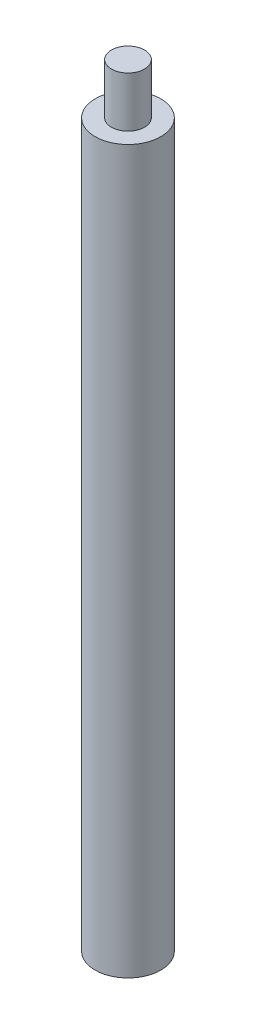
ISO-10303-21;
HEADER;
FILE_DESCRIPTION(('STEP AP214'),'2;1');
FILE_NAME('part.step','',(''),(''),'','','');
FILE_SCHEMA(('AUTOMOTIVE_DESIGN { 1 0 10303 214 1 1 1 1 }'));
ENDSEC;
DATA;
#1=APPLICATION_CONTEXT('core data for automotive mechanical design processes');
#2=APPLICATION_PROTOCOL_DEFINITION('international standard','automotive_design',2000,#1);
#3=PRODUCT_CONTEXT('',#1,'mechanical');
#4=PRODUCT('Part','Part','',(#3));
#5=PRODUCT_RELATED_PRODUCT_CATEGORY('part','',(#4));
#6=PRODUCT_DEFINITION_FORMATION('','',#4);
#7=PRODUCT_DEFINITION_CONTEXT('part definition',#1,'design');
#8=PRODUCT_DEFINITION('design','',#6,#7);
#9=PRODUCT_DEFINITION_SHAPE('','',#8);
#10=(LENGTH_UNIT() NAMED_UNIT(*) SI_UNIT(.MILLI.,.METRE.));
#11=(NAMED_UNIT(*) PLANE_ANGLE_UNIT() SI_UNIT($,.RADIAN.));
#12=(NAMED_UNIT(*) SI_UNIT($,.STERADIAN.) SOLID_ANGLE_UNIT());
#13=UNCERTAINTY_MEASURE_WITH_UNIT(LENGTH_MEASURE(1.E-05),#10,'distance_accuracy_value','');
#14=(GEOMETRIC_REPRESENTATION_CONTEXT(3) GLOBAL_UNCERTAINTY_ASSIGNED_CONTEXT((#13)) GLOBAL_UNIT_ASSIGNED_CONTEXT((#10,
#11,#12)) REPRESENTATION_CONTEXT('',''));
#15=CARTESIAN_POINT('',(0.,0.,0.));
#16=DIRECTION('',(0.,0.,1.));
#17=DIRECTION('',(1.,0.,0.));
#18=AXIS2_PLACEMENT_3D('',#15,#16,#17);
#19=CARTESIAN_POINT('',(0.,43.6372,0.));
#20=DIRECTION('',(0.,-1.,0.));
#21=DIRECTION('',(0.,0.,-1.));
#22=AXIS2_PLACEMENT_3D('',#19,#20,#21);
#23=CYLINDRICAL_SURFACE('',#22,1.984375);
#24=CARTESIAN_POINT('',(0.,43.6372,0.));
#25=DIRECTION('',(0.,1.,0.));
#26=DIRECTION('',(0.,0.,1.));
#27=AXIS2_PLACEMENT_3D('',#24,#25,#26);
#28=CIRCLE('',#27,1.984375);
#29=CARTESIAN_POINT('',(0.,43.6372,1.984375));
#30=VERTEX_POINT('',#29);
#31=EDGE_CURVE('E11',#30,#30,#28,.T.);
#32=ORIENTED_EDGE('',*,*,#31,.F.);
#33=EDGE_LOOP('',(#32));
#34=FACE_BOUND('',#33,.T.);
#35=CARTESIAN_POINT('',(0.,0.,0.));
#36=DIRECTION('',(0.,1.,0.));
#37=DIRECTION('',(0.,0.,1.));
#38=AXIS2_PLACEMENT_3D('',#35,#36,#37);
#39=CIRCLE('',#38,1.984375);
#40=CARTESIAN_POINT('',(0.,0.,1.984375));
#41=VERTEX_POINT('',#40);
#42=EDGE_CURVE('E44',#41,#41,#39,.T.);
#43=ORIENTED_EDGE('',*,*,#42,.T.);
#44=EDGE_LOOP('',(#43));
#45=FACE_BOUND('',#44,.T.);
#46=ADVANCED_FACE('F41',(#34,#45),#23,.T.);
#47=CARTESIAN_POINT('',(0.,43.6372,0.));
#48=DIRECTION('',(0.,1.,0.));
#49=DIRECTION('',(0.,0.,1.));
#50=AXIS2_PLACEMENT_3D('',#47,#48,#49);
#51=PLANE('',#50);
#52=CARTESIAN_POINT('',(0.,43.6372,0.));
#53=DIRECTION('',(0.,1.,0.));
#54=DIRECTION('',(0.,0.,1.));
#55=AXIS2_PLACEMENT_3D('',#52,#53,#54);
#56=CIRCLE('',#55,1.);
#57=CARTESIAN_POINT('',(0.,43.6372,1.));
#58=VERTEX_POINT('',#57);
#59=EDGE_CURVE('E62',#58,#58,#56,.T.);
#60=ORIENTED_EDGE('',*,*,#59,.F.);
#61=EDGE_LOOP('',(#60));
#62=FACE_BOUND('',#61,.T.);
#63=ORIENTED_EDGE('',*,*,#31,.T.);
#64=EDGE_LOOP('',(#63));
#65=FACE_BOUND('',#64,.T.);
#66=ADVANCED_FACE('F85',(#62,#65),#51,.T.);
#67=CARTESIAN_POINT('',(0.,0.,0.));
#68=DIRECTION('',(0.,1.,0.));
#69=DIRECTION('',(0.,0.,1.));
#70=AXIS2_PLACEMENT_3D('',#67,#68,#69);
#71=PLANE('',#70);
#72=CARTESIAN_POINT('',(0.,0.,0.));
#73=DIRECTION('',(0.,-1.,0.));
#74=DIRECTION('',(0.,0.,-1.));
#75=AXIS2_PLACEMENT_3D('',#72,#73,#74);
#76=CIRCLE('',#75,0.799999999999999);
#77=CARTESIAN_POINT('',(0.,0.,-0.799999999999999));
#78=VERTEX_POINT('',#77);
#79=EDGE_CURVE('E63',#78,#78,#76,.T.);
#80=ORIENTED_EDGE('',*,*,#79,.F.);
#81=EDGE_LOOP('',(#80));
#82=FACE_BOUND('',#81,.T.);
#83=ORIENTED_EDGE('',*,*,#42,.F.);
#84=EDGE_LOOP('',(#83));
#85=FACE_BOUND('',#84,.T.);
#86=ADVANCED_FACE('F82',(#82,#85),#71,.F.);
#87=CARTESIAN_POINT('',(0.,46.6852,0.));
#88=DIRECTION('',(0.,-1.,0.));
#89=DIRECTION('',(0.,0.,-1.));
#90=AXIS2_PLACEMENT_3D('',#87,#88,#89);
#91=CYLINDRICAL_SURFACE('',#90,1.);
#92=CARTESIAN_POINT('',(0.,46.6852,0.));
#93=DIRECTION('',(0.,1.,0.));
#94=DIRECTION('',(0.,0.,1.));
#95=AXIS2_PLACEMENT_3D('',#92,#93,#94);
#96=CIRCLE('',#95,1.);
#97=CARTESIAN_POINT('',(0.,46.6852,1.));
#98=VERTEX_POINT('',#97);
#99=EDGE_CURVE('E68',#98,#98,#96,.T.);
#100=ORIENTED_EDGE('',*,*,#99,.F.);
#101=EDGE_LOOP('',(#100));
#102=FACE_BOUND('',#101,.T.);
#103=ORIENTED_EDGE('',*,*,#59,.T.);
#104=EDGE_LOOP('',(#103));
#105=FACE_BOUND('',#104,.T.);
#106=ADVANCED_FACE('F84',(#102,#105),#91,.T.);
#107=CARTESIAN_POINT('',(0.,46.6852,0.));
#108=DIRECTION('',(0.,1.,0.));
#109=DIRECTION('',(0.,0.,1.));
#110=AXIS2_PLACEMENT_3D('',#107,#108,#109);
#111=PLANE('',#110);
#112=ORIENTED_EDGE('',*,*,#99,.T.);
#113=EDGE_LOOP('',(#112));
#114=FACE_BOUND('',#113,.T.);
#115=ADVANCED_FACE('F55',(#114),#111,.T.);
#116=CARTESIAN_POINT('',(0.,5.207,0.));
#117=DIRECTION('',(0.,-1.,0.));
#118=DIRECTION('',(0.,0.,-1.));
#119=AXIS2_PLACEMENT_3D('',#116,#117,#118);
#120=CONICAL_SURFACE('',#119,0.799999999999999,1.02974425867665);
#121=CARTESIAN_POINT('',(0.,5.68768849522205,0.));
#122=VERTEX_POINT('',#121);
#123=VERTEX_LOOP('',#122);
#124=FACE_BOUND('',#123,.T.);
#125=CARTESIAN_POINT('',(0.,5.207,0.));
#126=DIRECTION('',(0.,-1.,0.));
#127=DIRECTION('',(0.,0.,-1.));
#128=AXIS2_PLACEMENT_3D('',#125,#126,#127);
#129=CIRCLE('',#128,0.799999999999999);
#130=CARTESIAN_POINT('',(0.,5.207,-0.799999999999999));
#131=VERTEX_POINT('',#130);
#132=EDGE_CURVE('E59',#131,#131,#129,.T.);
#133=ORIENTED_EDGE('',*,*,#132,.T.);
#134=EDGE_LOOP('',(#133));
#135=FACE_BOUND('',#134,.T.);
#136=ADVANCED_FACE('F51',(#124,#135),#120,.F.);
#137=CARTESIAN_POINT('',(0.,0.,0.));
#138=DIRECTION('',(0.,-1.,0.));
#139=DIRECTION('',(0.,0.,-1.));
#140=AXIS2_PLACEMENT_3D('',#137,#138,#139);
#141=CYLINDRICAL_SURFACE('',#140,0.799999999999999);
#142=ORIENTED_EDGE('',*,*,#132,.F.);
#143=EDGE_LOOP('',(#142));
#144=FACE_BOUND('',#143,.T.);
#145=ORIENTED_EDGE('',*,*,#79,.T.);
#146=EDGE_LOOP('',(#145));
#147=FACE_BOUND('',#146,.T.);
#148=ADVANCED_FACE('F54',(#144,#147),#141,.F.);
#149=CLOSED_SHELL('',(#46,#66,#86,#106,#115,#136,#148));
#150=MANIFOLD_SOLID_BREP('B2',#149);
#151=ADVANCED_BREP_SHAPE_REPRESENTATION('',(#18,#150),#14);
#152=SHAPE_DEFINITION_REPRESENTATION(#9,#151);
ENDSEC;
END-ISO-10303-21;
